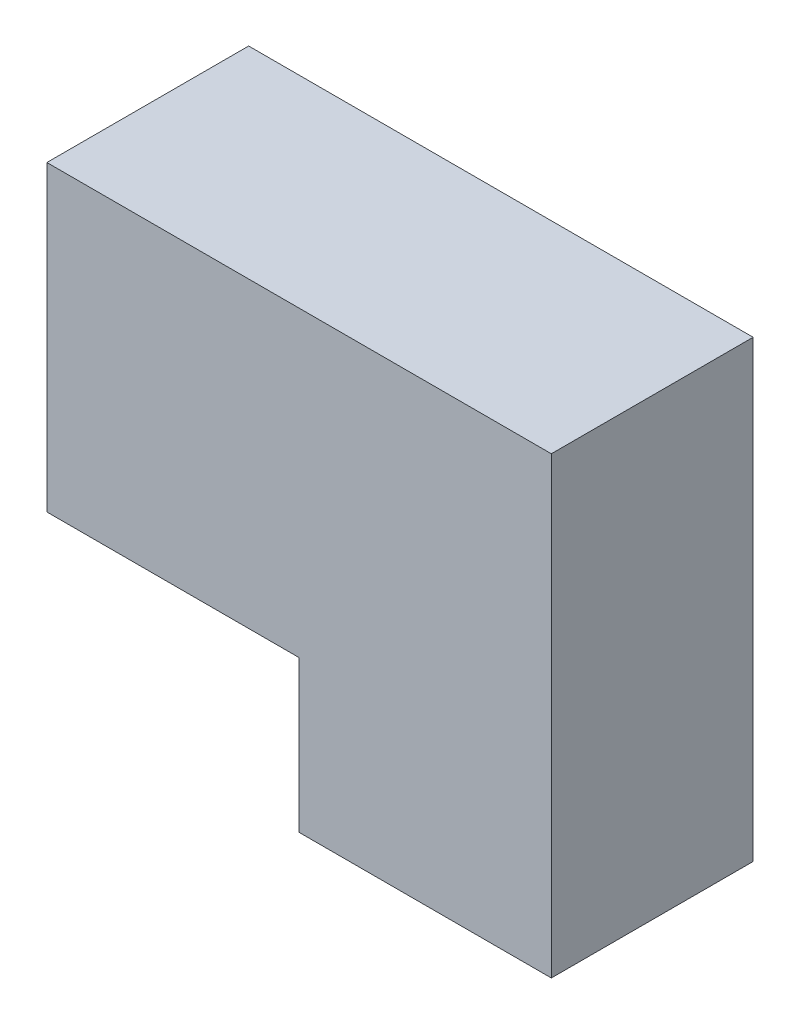
ISO-10303-21;
HEADER;
FILE_DESCRIPTION(('STEP AP214'),'2;1');
FILE_NAME('part.step','',(''),(''),'','','');
FILE_SCHEMA(('AUTOMOTIVE_DESIGN { 1 0 10303 214 1 1 1 1 }'));
ENDSEC;
DATA;
#1=APPLICATION_CONTEXT('core data for automotive mechanical design processes');
#2=APPLICATION_PROTOCOL_DEFINITION('international standard','automotive_design',2000,#1);
#3=PRODUCT_CONTEXT('',#1,'mechanical');
#4=PRODUCT('Part','Part','',(#3));
#5=PRODUCT_RELATED_PRODUCT_CATEGORY('part','',(#4));
#6=PRODUCT_DEFINITION_FORMATION('','',#4);
#7=PRODUCT_DEFINITION_CONTEXT('part definition',#1,'design');
#8=PRODUCT_DEFINITION('design','',#6,#7);
#9=PRODUCT_DEFINITION_SHAPE('','',#8);
#10=(LENGTH_UNIT() NAMED_UNIT(*) SI_UNIT(.MILLI.,.METRE.));
#11=(NAMED_UNIT(*) PLANE_ANGLE_UNIT() SI_UNIT($,.RADIAN.));
#12=(NAMED_UNIT(*) SI_UNIT($,.STERADIAN.) SOLID_ANGLE_UNIT());
#13=UNCERTAINTY_MEASURE_WITH_UNIT(LENGTH_MEASURE(1.E-05),#10,'distance_accuracy_value','');
#14=(GEOMETRIC_REPRESENTATION_CONTEXT(3) GLOBAL_UNCERTAINTY_ASSIGNED_CONTEXT((#13)) GLOBAL_UNIT_ASSIGNED_CONTEXT((#10,
#11,#12)) REPRESENTATION_CONTEXT('',''));
#15=CARTESIAN_POINT('',(0.,0.,0.));
#16=DIRECTION('',(0.,0.,1.));
#17=DIRECTION('',(1.,0.,0.));
#18=AXIS2_PLACEMENT_3D('',#15,#16,#17);
#19=CARTESIAN_POINT('',(5.,0.,4.));
#20=DIRECTION('',(0.,1.,0.));
#21=DIRECTION('',(-1.,0.,0.));
#22=AXIS2_PLACEMENT_3D('',#19,#20,#21);
#23=PLANE('',#22);
#24=DIRECTION('',(1.,0.,0.));
#25=VECTOR('',#24,1.);
#26=CARTESIAN_POINT('',(5.,0.,0.));
#27=LINE('',#26,#25);
#28=CARTESIAN_POINT('',(0.,0.,0.));
#29=VERTEX_POINT('',#28);
#30=CARTESIAN_POINT('',(5.,0.,0.));
#31=VERTEX_POINT('',#30);
#32=EDGE_CURVE('E116',#29,#31,#27,.T.);
#33=ORIENTED_EDGE('',*,*,#32,.T.);
#34=DIRECTION('',(0.,0.,-1.));
#35=VECTOR('',#34,1.);
#36=CARTESIAN_POINT('',(5.,0.,4.));
#37=LINE('',#36,#35);
#38=CARTESIAN_POINT('',(5.,0.,4.));
#39=VERTEX_POINT('',#38);
#40=EDGE_CURVE('E11',#39,#31,#37,.T.);
#41=ORIENTED_EDGE('',*,*,#40,.F.);
#42=DIRECTION('',(1.,0.,0.));
#43=VECTOR('',#42,1.);
#44=CARTESIAN_POINT('',(5.,0.,4.));
#45=LINE('',#44,#43);
#46=CARTESIAN_POINT('',(0.,0.,4.));
#47=VERTEX_POINT('',#46);
#48=EDGE_CURVE('E126',#47,#39,#45,.T.);
#49=ORIENTED_EDGE('',*,*,#48,.F.);
#50=DIRECTION('',(0.,0.,-1.));
#51=VECTOR('',#50,1.);
#52=CARTESIAN_POINT('',(0.,0.,4.));
#53=LINE('',#52,#51);
#54=EDGE_CURVE('E112',#47,#29,#53,.T.);
#55=ORIENTED_EDGE('',*,*,#54,.T.);
#56=EDGE_LOOP('',(#33,#41,#49,#55));
#57=FACE_BOUND('',#56,.T.);
#58=ADVANCED_FACE('F32',(#57),#23,.F.);
#59=CARTESIAN_POINT('',(5.,9.,4.));
#60=DIRECTION('',(-1.,0.,0.));
#61=DIRECTION('',(0.,-1.,0.));
#62=AXIS2_PLACEMENT_3D('',#59,#60,#61);
#63=PLANE('',#62);
#64=DIRECTION('',(0.,1.,0.));
#65=VECTOR('',#64,1.);
#66=CARTESIAN_POINT('',(5.,9.,0.));
#67=LINE('',#66,#65);
#68=CARTESIAN_POINT('',(5.,9.,0.));
#69=VERTEX_POINT('',#68);
#70=EDGE_CURVE('E119',#31,#69,#67,.T.);
#71=ORIENTED_EDGE('',*,*,#70,.T.);
#72=DIRECTION('',(0.,0.,-1.));
#73=VECTOR('',#72,1.);
#74=CARTESIAN_POINT('',(5.,9.,4.));
#75=LINE('',#74,#73);
#76=CARTESIAN_POINT('',(5.,9.,4.));
#77=VERTEX_POINT('',#76);
#78=EDGE_CURVE('E40',#77,#69,#75,.T.);
#79=ORIENTED_EDGE('',*,*,#78,.F.);
#80=DIRECTION('',(0.,1.,0.));
#81=VECTOR('',#80,1.);
#82=CARTESIAN_POINT('',(5.,9.,4.));
#83=LINE('',#82,#81);
#84=EDGE_CURVE('E85',#39,#77,#83,.T.);
#85=ORIENTED_EDGE('',*,*,#84,.F.);
#86=ORIENTED_EDGE('',*,*,#40,.T.);
#87=EDGE_LOOP('',(#71,#79,#85,#86));
#88=FACE_BOUND('',#87,.T.);
#89=ADVANCED_FACE('F150',(#88),#63,.F.);
#90=CARTESIAN_POINT('',(-5.,9.,4.));
#91=DIRECTION('',(0.,-1.,0.));
#92=DIRECTION('',(0.,0.,-1.));
#93=AXIS2_PLACEMENT_3D('',#90,#91,#92);
#94=PLANE('',#93);
#95=DIRECTION('',(-1.,0.,0.));
#96=VECTOR('',#95,1.);
#97=CARTESIAN_POINT('',(-5.,9.,0.));
#98=LINE('',#97,#96);
#99=CARTESIAN_POINT('',(-5.,9.,0.));
#100=VERTEX_POINT('',#99);
#101=EDGE_CURVE('E121',#69,#100,#98,.T.);
#102=ORIENTED_EDGE('',*,*,#101,.T.);
#103=DIRECTION('',(0.,0.,-1.));
#104=VECTOR('',#103,1.);
#105=CARTESIAN_POINT('',(-5.,9.,4.));
#106=LINE('',#105,#104);
#107=CARTESIAN_POINT('',(-5.,9.,4.));
#108=VERTEX_POINT('',#107);
#109=EDGE_CURVE('E107',#108,#100,#106,.T.);
#110=ORIENTED_EDGE('',*,*,#109,.F.);
#111=DIRECTION('',(-1.,0.,0.));
#112=VECTOR('',#111,1.);
#113=CARTESIAN_POINT('',(-5.,9.,4.));
#114=LINE('',#113,#112);
#115=EDGE_CURVE('E98',#77,#108,#114,.T.);
#116=ORIENTED_EDGE('',*,*,#115,.F.);
#117=ORIENTED_EDGE('',*,*,#78,.T.);
#118=EDGE_LOOP('',(#102,#110,#116,#117));
#119=FACE_BOUND('',#118,.T.);
#120=ADVANCED_FACE('F132',(#119),#94,.F.);
#121=CARTESIAN_POINT('',(-5.,3.,4.));
#122=DIRECTION('',(1.,0.,0.));
#123=DIRECTION('',(0.,0.,-1.));
#124=AXIS2_PLACEMENT_3D('',#121,#122,#123);
#125=PLANE('',#124);
#126=DIRECTION('',(0.,-1.,0.));
#127=VECTOR('',#126,1.);
#128=CARTESIAN_POINT('',(-5.,3.,0.));
#129=LINE('',#128,#127);
#130=CARTESIAN_POINT('',(-5.,3.,0.));
#131=VERTEX_POINT('',#130);
#132=EDGE_CURVE('E106',#100,#131,#129,.T.);
#133=ORIENTED_EDGE('',*,*,#132,.T.);
#134=DIRECTION('',(0.,0.,-1.));
#135=VECTOR('',#134,1.);
#136=CARTESIAN_POINT('',(-5.,3.,4.));
#137=LINE('',#136,#135);
#138=CARTESIAN_POINT('',(-5.,3.,4.));
#139=VERTEX_POINT('',#138);
#140=EDGE_CURVE('E103',#139,#131,#137,.T.);
#141=ORIENTED_EDGE('',*,*,#140,.F.);
#142=DIRECTION('',(0.,-1.,0.));
#143=VECTOR('',#142,1.);
#144=CARTESIAN_POINT('',(-5.,3.,4.));
#145=LINE('',#144,#143);
#146=EDGE_CURVE('E92',#108,#139,#145,.T.);
#147=ORIENTED_EDGE('',*,*,#146,.F.);
#148=ORIENTED_EDGE('',*,*,#109,.T.);
#149=EDGE_LOOP('',(#133,#141,#147,#148));
#150=FACE_BOUND('',#149,.T.);
#151=ADVANCED_FACE('F104',(#150),#125,.F.);
#152=CARTESIAN_POINT('',(0.,3.,4.));
#153=DIRECTION('',(0.,1.,0.));
#154=DIRECTION('',(-1.,0.,0.));
#155=AXIS2_PLACEMENT_3D('',#152,#153,#154);
#156=PLANE('',#155);
#157=DIRECTION('',(1.,0.,0.));
#158=VECTOR('',#157,1.);
#159=CARTESIAN_POINT('',(0.,3.,0.));
#160=LINE('',#159,#158);
#161=CARTESIAN_POINT('',(0.,3.,0.));
#162=VERTEX_POINT('',#161);
#163=EDGE_CURVE('E71',#131,#162,#160,.T.);
#164=ORIENTED_EDGE('',*,*,#163,.T.);
#165=DIRECTION('',(0.,0.,-1.));
#166=VECTOR('',#165,1.);
#167=CARTESIAN_POINT('',(0.,3.,4.));
#168=LINE('',#167,#166);
#169=CARTESIAN_POINT('',(0.,3.,4.));
#170=VERTEX_POINT('',#169);
#171=EDGE_CURVE('E108',#170,#162,#168,.T.);
#172=ORIENTED_EDGE('',*,*,#171,.F.);
#173=DIRECTION('',(1.,0.,0.));
#174=VECTOR('',#173,1.);
#175=CARTESIAN_POINT('',(0.,3.,4.));
#176=LINE('',#175,#174);
#177=EDGE_CURVE('E96',#139,#170,#176,.T.);
#178=ORIENTED_EDGE('',*,*,#177,.F.);
#179=ORIENTED_EDGE('',*,*,#140,.T.);
#180=EDGE_LOOP('',(#164,#172,#178,#179));
#181=FACE_BOUND('',#180,.T.);
#182=ADVANCED_FACE('F110',(#181),#156,.F.);
#183=CARTESIAN_POINT('',(0.,0.,4.));
#184=DIRECTION('',(1.,0.,0.));
#185=DIRECTION('',(0.,0.,-1.));
#186=AXIS2_PLACEMENT_3D('',#183,#184,#185);
#187=PLANE('',#186);
#188=DIRECTION('',(0.,-1.,0.));
#189=VECTOR('',#188,1.);
#190=CARTESIAN_POINT('',(0.,0.,0.));
#191=LINE('',#190,#189);
#192=EDGE_CURVE('E77',#162,#29,#191,.T.);
#193=ORIENTED_EDGE('',*,*,#192,.T.);
#194=ORIENTED_EDGE('',*,*,#54,.F.);
#195=DIRECTION('',(0.,-1.,0.));
#196=VECTOR('',#195,1.);
#197=CARTESIAN_POINT('',(0.,0.,4.));
#198=LINE('',#197,#196);
#199=EDGE_CURVE('E48',#170,#47,#198,.T.);
#200=ORIENTED_EDGE('',*,*,#199,.F.);
#201=ORIENTED_EDGE('',*,*,#171,.T.);
#202=EDGE_LOOP('',(#193,#194,#200,#201));
#203=FACE_BOUND('',#202,.T.);
#204=ADVANCED_FACE('F139',(#203),#187,.F.);
#205=CARTESIAN_POINT('',(0.,0.,4.));
#206=DIRECTION('',(0.,0.,-1.));
#207=DIRECTION('',(-1.,0.,0.));
#208=AXIS2_PLACEMENT_3D('',#205,#206,#207);
#209=PLANE('',#208);
#210=ORIENTED_EDGE('',*,*,#48,.T.);
#211=ORIENTED_EDGE('',*,*,#84,.T.);
#212=ORIENTED_EDGE('',*,*,#115,.T.);
#213=ORIENTED_EDGE('',*,*,#146,.T.);
#214=ORIENTED_EDGE('',*,*,#177,.T.);
#215=ORIENTED_EDGE('',*,*,#199,.T.);
#216=EDGE_LOOP('',(#210,#211,#212,#213,#214,#215));
#217=FACE_BOUND('',#216,.T.);
#218=ADVANCED_FACE('F94',(#217),#209,.F.);
#219=CARTESIAN_POINT('',(0.,0.,0.));
#220=DIRECTION('',(0.,0.,-1.));
#221=DIRECTION('',(-1.,0.,0.));
#222=AXIS2_PLACEMENT_3D('',#219,#220,#221);
#223=PLANE('',#222);
#224=ORIENTED_EDGE('',*,*,#32,.F.);
#225=ORIENTED_EDGE('',*,*,#192,.F.);
#226=ORIENTED_EDGE('',*,*,#163,.F.);
#227=ORIENTED_EDGE('',*,*,#132,.F.);
#228=ORIENTED_EDGE('',*,*,#101,.F.);
#229=ORIENTED_EDGE('',*,*,#70,.F.);
#230=EDGE_LOOP('',(#224,#225,#226,#227,#228,#229));
#231=FACE_BOUND('',#230,.T.);
#232=ADVANCED_FACE('F135',(#231),#223,.T.);
#233=CLOSED_SHELL('',(#58,#89,#120,#151,#182,#204,#218,#232));
#234=MANIFOLD_SOLID_BREP('B2',#233);
#235=ADVANCED_BREP_SHAPE_REPRESENTATION('',(#18,#234),#14);
#236=SHAPE_DEFINITION_REPRESENTATION(#9,#235);
ENDSEC;
END-ISO-10303-21;
